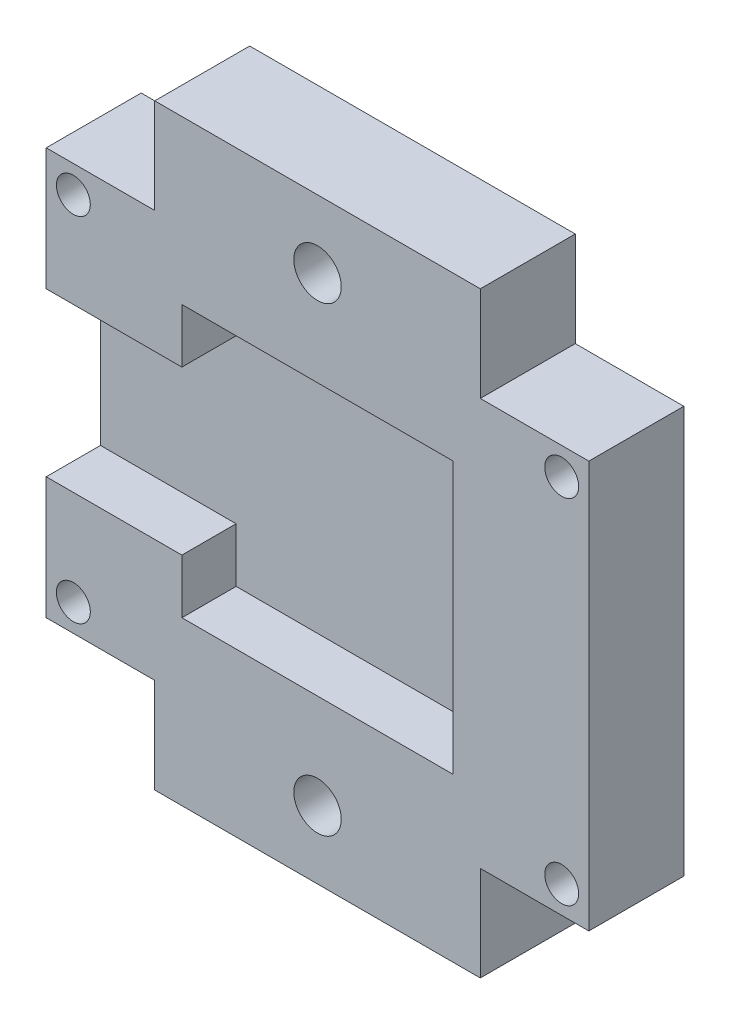
ISO-10303-21;
HEADER;
FILE_DESCRIPTION(('STEP AP214'),'2;1');
FILE_NAME('part.step','',(''),(''),'','','');
FILE_SCHEMA(('AUTOMOTIVE_DESIGN { 1 0 10303 214 1 1 1 1 }'));
ENDSEC;
DATA;
#1=APPLICATION_CONTEXT('core data for automotive mechanical design processes');
#2=APPLICATION_PROTOCOL_DEFINITION('international standard','automotive_design',2000,#1);
#3=PRODUCT_CONTEXT('',#1,'mechanical');
#4=PRODUCT('Part','Part','',(#3));
#5=PRODUCT_RELATED_PRODUCT_CATEGORY('part','',(#4));
#6=PRODUCT_DEFINITION_FORMATION('','',#4);
#7=PRODUCT_DEFINITION_CONTEXT('part definition',#1,'design');
#8=PRODUCT_DEFINITION('design','',#6,#7);
#9=PRODUCT_DEFINITION_SHAPE('','',#8);
#10=(LENGTH_UNIT() NAMED_UNIT(*) SI_UNIT(.MILLI.,.METRE.));
#11=(NAMED_UNIT(*) PLANE_ANGLE_UNIT() SI_UNIT($,.RADIAN.));
#12=(NAMED_UNIT(*) SI_UNIT($,.STERADIAN.) SOLID_ANGLE_UNIT());
#13=UNCERTAINTY_MEASURE_WITH_UNIT(LENGTH_MEASURE(1.E-05),#10,'distance_accuracy_value','');
#14=(GEOMETRIC_REPRESENTATION_CONTEXT(3) GLOBAL_UNCERTAINTY_ASSIGNED_CONTEXT((#13)) GLOBAL_UNIT_ASSIGNED_CONTEXT((#10,
#11,#12)) REPRESENTATION_CONTEXT('',''));
#15=CARTESIAN_POINT('',(0.,0.,0.));
#16=DIRECTION('',(0.,0.,1.));
#17=DIRECTION('',(1.,0.,0.));
#18=AXIS2_PLACEMENT_3D('',#15,#16,#17);
#19=CARTESIAN_POINT('',(0.,0.,7.));
#20=DIRECTION('',(0.,1.,0.));
#21=DIRECTION('',(0.,0.,1.));
#22=AXIS2_PLACEMENT_3D('',#19,#20,#21);
#23=PLANE('',#22);
#24=DIRECTION('',(0.,0.,1.));
#25=VECTOR('',#24,1.);
#26=CARTESIAN_POINT('',(32.,0.,0.));
#27=LINE('',#26,#25);
#28=CARTESIAN_POINT('',(32.,0.,0.));
#29=VERTEX_POINT('',#28);
#30=CARTESIAN_POINT('',(32.,0.,7.));
#31=VERTEX_POINT('',#30);
#32=EDGE_CURVE('E340',#29,#31,#27,.T.);
#33=ORIENTED_EDGE('',*,*,#32,.F.);
#34=DIRECTION('',(1.,0.,0.));
#35=VECTOR('',#34,1.);
#36=CARTESIAN_POINT('',(0.,0.,0.));
#37=LINE('',#36,#35);
#38=CARTESIAN_POINT('',(40.,0.,0.));
#39=VERTEX_POINT('',#38);
#40=EDGE_CURVE('E193',#29,#39,#37,.T.);
#41=ORIENTED_EDGE('',*,*,#40,.T.);
#42=DIRECTION('',(0.,0.,-1.));
#43=VECTOR('',#42,1.);
#44=CARTESIAN_POINT('',(40.,0.,7.));
#45=LINE('',#44,#43);
#46=CARTESIAN_POINT('',(40.,0.,7.));
#47=VERTEX_POINT('',#46);
#48=EDGE_CURVE('E41',#47,#39,#45,.T.);
#49=ORIENTED_EDGE('',*,*,#48,.F.);
#50=DIRECTION('',(1.,0.,0.));
#51=VECTOR('',#50,1.);
#52=CARTESIAN_POINT('',(0.,0.,7.));
#53=LINE('',#52,#51);
#54=EDGE_CURVE('E238',#31,#47,#53,.T.);
#55=ORIENTED_EDGE('',*,*,#54,.F.);
#56=EDGE_LOOP('',(#33,#41,#49,#55));
#57=FACE_BOUND('',#56,.T.);
#58=ADVANCED_FACE('F33',(#57),#23,.F.);
#59=CARTESIAN_POINT('',(0.,30.,7.));
#60=DIRECTION('',(0.,-1.,0.));
#61=DIRECTION('',(0.,0.,-1.));
#62=AXIS2_PLACEMENT_3D('',#59,#60,#61);
#63=PLANE('',#62);
#64=DIRECTION('',(0.,0.,1.));
#65=VECTOR('',#64,1.);
#66=CARTESIAN_POINT('',(8.,30.,0.));
#67=LINE('',#66,#65);
#68=CARTESIAN_POINT('',(8.,30.,0.));
#69=VERTEX_POINT('',#68);
#70=CARTESIAN_POINT('',(8.,30.,7.));
#71=VERTEX_POINT('',#70);
#72=EDGE_CURVE('E325',#69,#71,#67,.T.);
#73=ORIENTED_EDGE('',*,*,#72,.F.);
#74=DIRECTION('',(-1.,0.,0.));
#75=VECTOR('',#74,1.);
#76=CARTESIAN_POINT('',(0.,30.,0.));
#77=LINE('',#76,#75);
#78=CARTESIAN_POINT('',(0.,30.,0.));
#79=VERTEX_POINT('',#78);
#80=EDGE_CURVE('E195',#69,#79,#77,.T.);
#81=ORIENTED_EDGE('',*,*,#80,.T.);
#82=DIRECTION('',(0.,0.,-1.));
#83=VECTOR('',#82,1.);
#84=CARTESIAN_POINT('',(0.,30.,7.));
#85=LINE('',#84,#83);
#86=CARTESIAN_POINT('',(0.,30.,7.));
#87=VERTEX_POINT('',#86);
#88=EDGE_CURVE('E205',#87,#79,#85,.T.);
#89=ORIENTED_EDGE('',*,*,#88,.F.);
#90=DIRECTION('',(-1.,0.,0.));
#91=VECTOR('',#90,1.);
#92=CARTESIAN_POINT('',(0.,30.,7.));
#93=LINE('',#92,#91);
#94=EDGE_CURVE('E233',#71,#87,#93,.T.);
#95=ORIENTED_EDGE('',*,*,#94,.F.);
#96=EDGE_LOOP('',(#73,#81,#89,#95));
#97=FACE_BOUND('',#96,.T.);
#98=ADVANCED_FACE('F421',(#97),#63,.F.);
#99=CARTESIAN_POINT('',(10.,25.,3.));
#100=DIRECTION('',(-1.,0.,0.));
#101=DIRECTION('',(0.,0.,1.));
#102=AXIS2_PLACEMENT_3D('',#99,#100,#101);
#103=PLANE('',#102);
#104=DIRECTION('',(0.,-1.,0.));
#105=VECTOR('',#104,1.);
#106=CARTESIAN_POINT('',(10.,25.,3.));
#107=LINE('',#106,#105);
#108=CARTESIAN_POINT('',(10.,9.,3.));
#109=VERTEX_POINT('',#108);
#110=CARTESIAN_POINT('',(10.,5.,3.));
#111=VERTEX_POINT('',#110);
#112=EDGE_CURVE('E255',#109,#111,#107,.T.);
#113=ORIENTED_EDGE('',*,*,#112,.F.);
#114=DIRECTION('',(0.,0.,1.));
#115=VECTOR('',#114,1.);
#116=CARTESIAN_POINT('',(10.,9.,3.));
#117=LINE('',#116,#115);
#118=CARTESIAN_POINT('',(10.,9.,7.));
#119=VERTEX_POINT('',#118);
#120=EDGE_CURVE('E277',#109,#119,#117,.T.);
#121=ORIENTED_EDGE('',*,*,#120,.T.);
#122=DIRECTION('',(0.,-1.,0.));
#123=VECTOR('',#122,1.);
#124=CARTESIAN_POINT('',(10.,25.,7.));
#125=LINE('',#124,#123);
#126=CARTESIAN_POINT('',(10.,5.,7.));
#127=VERTEX_POINT('',#126);
#128=EDGE_CURVE('E265',#119,#127,#125,.T.);
#129=ORIENTED_EDGE('',*,*,#128,.T.);
#130=DIRECTION('',(0.,0.,1.));
#131=VECTOR('',#130,1.);
#132=CARTESIAN_POINT('',(10.,5.,3.));
#133=LINE('',#132,#131);
#134=EDGE_CURVE('E242',#111,#127,#133,.T.);
#135=ORIENTED_EDGE('',*,*,#134,.F.);
#136=EDGE_LOOP('',(#113,#121,#129,#135));
#137=FACE_BOUND('',#136,.T.);
#138=ADVANCED_FACE('F399',(#137),#103,.F.);
#139=CARTESIAN_POINT('',(0.,0.,7.));
#140=DIRECTION('',(1.,0.,0.));
#141=DIRECTION('',(0.,0.,-1.));
#142=AXIS2_PLACEMENT_3D('',#139,#140,#141);
#143=PLANE('',#142);
#144=DIRECTION('',(0.,-1.,0.));
#145=VECTOR('',#144,1.);
#146=CARTESIAN_POINT('',(0.,0.,7.));
#147=LINE('',#146,#145);
#148=CARTESIAN_POINT('',(0.,9.,7.));
#149=VERTEX_POINT('',#148);
#150=CARTESIAN_POINT('',(0.,0.,7.));
#151=VERTEX_POINT('',#150);
#152=EDGE_CURVE('E204',#149,#151,#147,.T.);
#153=ORIENTED_EDGE('',*,*,#152,.F.);
#154=DIRECTION('',(0.,0.,1.));
#155=VECTOR('',#154,1.);
#156=CARTESIAN_POINT('',(0.,9.,7.));
#157=LINE('',#156,#155);
#158=CARTESIAN_POINT('',(0.,9.,3.));
#159=VERTEX_POINT('',#158);
#160=EDGE_CURVE('E287',#159,#149,#157,.T.);
#161=ORIENTED_EDGE('',*,*,#160,.F.);
#162=DIRECTION('',(0.,-1.,0.));
#163=VECTOR('',#162,1.);
#164=CARTESIAN_POINT('',(0.,21.,3.));
#165=LINE('',#164,#163);
#166=CARTESIAN_POINT('',(0.,21.,3.));
#167=VERTEX_POINT('',#166);
#168=EDGE_CURVE('E294',#167,#159,#165,.T.);
#169=ORIENTED_EDGE('',*,*,#168,.F.);
#170=DIRECTION('',(0.,0.,-1.));
#171=VECTOR('',#170,1.);
#172=CARTESIAN_POINT('',(0.,21.,7.));
#173=LINE('',#172,#171);
#174=CARTESIAN_POINT('',(0.,21.,7.));
#175=VERTEX_POINT('',#174);
#176=EDGE_CURVE('E297',#175,#167,#173,.T.);
#177=ORIENTED_EDGE('',*,*,#176,.F.);
#178=EDGE_CURVE('E239',#87,#175,#147,.T.);
#179=ORIENTED_EDGE('',*,*,#178,.F.);
#180=ORIENTED_EDGE('',*,*,#88,.T.);
#181=DIRECTION('',(0.,-1.,0.));
#182=VECTOR('',#181,1.);
#183=CARTESIAN_POINT('',(0.,0.,0.));
#184=LINE('',#183,#182);
#185=CARTESIAN_POINT('',(0.,0.,0.));
#186=VERTEX_POINT('',#185);
#187=EDGE_CURVE('E197',#79,#186,#184,.T.);
#188=ORIENTED_EDGE('',*,*,#187,.T.);
#189=DIRECTION('',(0.,0.,-1.));
#190=VECTOR('',#189,1.);
#191=CARTESIAN_POINT('',(0.,0.,7.));
#192=LINE('',#191,#190);
#193=EDGE_CURVE('E11',#151,#186,#192,.T.);
#194=ORIENTED_EDGE('',*,*,#193,.F.);
#195=EDGE_LOOP('',(#153,#161,#169,#177,#179,#180,#188,#194));
#196=FACE_BOUND('',#195,.T.);
#197=ADVANCED_FACE('F35',(#196),#143,.F.);
#198=CARTESIAN_POINT('',(8.,0.,0.));
#199=VERTEX_POINT('',#198);
#200=EDGE_CURVE('E183',#186,#199,#37,.T.);
#201=ORIENTED_EDGE('',*,*,#200,.T.);
#202=DIRECTION('',(0.,0.,1.));
#203=VECTOR('',#202,1.);
#204=CARTESIAN_POINT('',(8.,0.,0.));
#205=LINE('',#204,#203);
#206=CARTESIAN_POINT('',(8.,0.,7.));
#207=VERTEX_POINT('',#206);
#208=EDGE_CURVE('E168',#199,#207,#205,.T.);
#209=ORIENTED_EDGE('',*,*,#208,.T.);
#210=EDGE_CURVE('E236',#151,#207,#53,.T.);
#211=ORIENTED_EDGE('',*,*,#210,.F.);
#212=ORIENTED_EDGE('',*,*,#193,.T.);
#213=EDGE_LOOP('',(#201,#209,#211,#212));
#214=FACE_BOUND('',#213,.T.);
#215=ADVANCED_FACE('F189',(#214),#23,.F.);
#216=CARTESIAN_POINT('',(40.,0.,7.));
#217=DIRECTION('',(-1.,0.,0.));
#218=DIRECTION('',(0.,0.,1.));
#219=AXIS2_PLACEMENT_3D('',#216,#217,#218);
#220=PLANE('',#219);
#221=DIRECTION('',(0.,1.,0.));
#222=VECTOR('',#221,1.);
#223=CARTESIAN_POINT('',(40.,0.,0.));
#224=LINE('',#223,#222);
#225=CARTESIAN_POINT('',(40.,30.,0.));
#226=VERTEX_POINT('',#225);
#227=EDGE_CURVE('E192',#39,#226,#224,.T.);
#228=ORIENTED_EDGE('',*,*,#227,.T.);
#229=DIRECTION('',(0.,0.,-1.));
#230=VECTOR('',#229,1.);
#231=CARTESIAN_POINT('',(40.,30.,7.));
#232=LINE('',#231,#230);
#233=CARTESIAN_POINT('',(40.,30.,7.));
#234=VERTEX_POINT('',#233);
#235=EDGE_CURVE('E208',#234,#226,#232,.T.);
#236=ORIENTED_EDGE('',*,*,#235,.F.);
#237=DIRECTION('',(0.,1.,0.));
#238=VECTOR('',#237,1.);
#239=CARTESIAN_POINT('',(40.,0.,7.));
#240=LINE('',#239,#238);
#241=EDGE_CURVE('E218',#47,#234,#240,.T.);
#242=ORIENTED_EDGE('',*,*,#241,.F.);
#243=ORIENTED_EDGE('',*,*,#48,.T.);
#244=EDGE_LOOP('',(#228,#236,#242,#243));
#245=FACE_BOUND('',#244,.T.);
#246=ADVANCED_FACE('F216',(#245),#220,.F.);
#247=CARTESIAN_POINT('',(32.,30.,0.));
#248=VERTEX_POINT('',#247);
#249=EDGE_CURVE('E201',#226,#248,#77,.T.);
#250=ORIENTED_EDGE('',*,*,#249,.T.);
#251=DIRECTION('',(0.,0.,1.));
#252=VECTOR('',#251,1.);
#253=CARTESIAN_POINT('',(32.,30.,0.));
#254=LINE('',#253,#252);
#255=CARTESIAN_POINT('',(32.,30.,7.));
#256=VERTEX_POINT('',#255);
#257=EDGE_CURVE('E230',#248,#256,#254,.T.);
#258=ORIENTED_EDGE('',*,*,#257,.T.);
#259=EDGE_CURVE('E209',#234,#256,#93,.T.);
#260=ORIENTED_EDGE('',*,*,#259,.F.);
#261=ORIENTED_EDGE('',*,*,#235,.T.);
#262=EDGE_LOOP('',(#250,#258,#260,#261));
#263=FACE_BOUND('',#262,.T.);
#264=ADVANCED_FACE('F228',(#263),#63,.F.);
#265=CARTESIAN_POINT('',(0.,0.,7.));
#266=DIRECTION('',(0.,0.,-1.));
#267=DIRECTION('',(-1.,0.,0.));
#268=AXIS2_PLACEMENT_3D('',#265,#266,#267);
#269=PLANE('',#268);
#270=CARTESIAN_POINT('',(20.,32.,7.));
#271=DIRECTION('',(0.,0.,1.));
#272=DIRECTION('',(-1.,0.,0.));
#273=AXIS2_PLACEMENT_3D('',#270,#271,#272);
#274=CIRCLE('',#273,1.75);
#275=CARTESIAN_POINT('',(18.25,32.,7.));
#276=VERTEX_POINT('',#275);
#277=EDGE_CURVE('E364',#276,#276,#274,.T.);
#278=ORIENTED_EDGE('',*,*,#277,.F.);
#279=EDGE_LOOP('',(#278));
#280=FACE_BOUND('',#279,.T.);
#281=CARTESIAN_POINT('',(20.,-2.,7.));
#282=DIRECTION('',(0.,0.,1.));
#283=DIRECTION('',(1.,0.,0.));
#284=AXIS2_PLACEMENT_3D('',#281,#282,#283);
#285=CIRCLE('',#284,1.75);
#286=CARTESIAN_POINT('',(21.75,-2.,7.));
#287=VERTEX_POINT('',#286);
#288=EDGE_CURVE('E358',#287,#287,#285,.T.);
#289=ORIENTED_EDGE('',*,*,#288,.F.);
#290=EDGE_LOOP('',(#289));
#291=FACE_BOUND('',#290,.T.);
#292=CARTESIAN_POINT('',(38.,28.,7.));
#293=DIRECTION('',(0.,0.,1.));
#294=DIRECTION('',(-1.,0.,0.));
#295=AXIS2_PLACEMENT_3D('',#292,#293,#294);
#296=CIRCLE('',#295,1.25);
#297=CARTESIAN_POINT('',(36.75,28.,7.));
#298=VERTEX_POINT('',#297);
#299=EDGE_CURVE('E320',#298,#298,#296,.T.);
#300=ORIENTED_EDGE('',*,*,#299,.F.);
#301=EDGE_LOOP('',(#300));
#302=FACE_BOUND('',#301,.T.);
#303=CARTESIAN_POINT('',(38.,2.,7.));
#304=DIRECTION('',(0.,0.,1.));
#305=DIRECTION('',(1.,0.,0.));
#306=AXIS2_PLACEMENT_3D('',#303,#304,#305);
#307=CIRCLE('',#306,1.25);
#308=CARTESIAN_POINT('',(39.25,2.,7.));
#309=VERTEX_POINT('',#308);
#310=EDGE_CURVE('E314',#309,#309,#307,.T.);
#311=ORIENTED_EDGE('',*,*,#310,.F.);
#312=EDGE_LOOP('',(#311));
#313=FACE_BOUND('',#312,.T.);
#314=CARTESIAN_POINT('',(2.,2.,7.));
#315=DIRECTION('',(0.,0.,1.));
#316=DIRECTION('',(-1.,0.,0.));
#317=AXIS2_PLACEMENT_3D('',#314,#315,#316);
#318=CIRCLE('',#317,1.25);
#319=CARTESIAN_POINT('',(0.750000000000001,2.,7.));
#320=VERTEX_POINT('',#319);
#321=EDGE_CURVE('E307',#320,#320,#318,.T.);
#322=ORIENTED_EDGE('',*,*,#321,.F.);
#323=EDGE_LOOP('',(#322));
#324=FACE_BOUND('',#323,.T.);
#325=CARTESIAN_POINT('',(2.,28.,7.));
#326=DIRECTION('',(0.,0.,1.));
#327=DIRECTION('',(1.,0.,0.));
#328=AXIS2_PLACEMENT_3D('',#325,#326,#327);
#329=CIRCLE('',#328,1.25);
#330=CARTESIAN_POINT('',(3.25,28.,7.));
#331=VERTEX_POINT('',#330);
#332=EDGE_CURVE('E301',#331,#331,#329,.T.);
#333=ORIENTED_EDGE('',*,*,#332,.F.);
#334=EDGE_LOOP('',(#333));
#335=FACE_BOUND('',#334,.T.);
#336=ORIENTED_EDGE('',*,*,#128,.F.);
#337=DIRECTION('',(-1.,0.,0.));
#338=VECTOR('',#337,1.);
#339=CARTESIAN_POINT('',(26.,9.,7.));
#340=LINE('',#339,#338);
#341=EDGE_CURVE('E283',#119,#149,#340,.T.);
#342=ORIENTED_EDGE('',*,*,#341,.T.);
#343=ORIENTED_EDGE('',*,*,#152,.T.);
#344=ORIENTED_EDGE('',*,*,#210,.T.);
#345=DIRECTION('',(0.,-1.,0.));
#346=VECTOR('',#345,1.);
#347=CARTESIAN_POINT('',(8.,0.,7.));
#348=LINE('',#347,#346);
#349=CARTESIAN_POINT('',(8.,-7.,7.));
#350=VERTEX_POINT('',#349);
#351=EDGE_CURVE('E48',#207,#350,#348,.T.);
#352=ORIENTED_EDGE('',*,*,#351,.T.);
#353=DIRECTION('',(1.,0.,0.));
#354=VECTOR('',#353,1.);
#355=CARTESIAN_POINT('',(8.,-7.,7.));
#356=LINE('',#355,#354);
#357=CARTESIAN_POINT('',(32.,-7.00000000000001,7.));
#358=VERTEX_POINT('',#357);
#359=EDGE_CURVE('E351',#350,#358,#356,.T.);
#360=ORIENTED_EDGE('',*,*,#359,.T.);
#361=DIRECTION('',(0.,1.,0.));
#362=VECTOR('',#361,1.);
#363=CARTESIAN_POINT('',(32.,0.,7.));
#364=LINE('',#363,#362);
#365=EDGE_CURVE('E187',#358,#31,#364,.T.);
#366=ORIENTED_EDGE('',*,*,#365,.T.);
#367=ORIENTED_EDGE('',*,*,#54,.T.);
#368=ORIENTED_EDGE('',*,*,#241,.T.);
#369=ORIENTED_EDGE('',*,*,#259,.T.);
#370=DIRECTION('',(0.,1.,0.));
#371=VECTOR('',#370,1.);
#372=CARTESIAN_POINT('',(32.,30.,7.));
#373=LINE('',#372,#371);
#374=CARTESIAN_POINT('',(32.,37.,7.));
#375=VERTEX_POINT('',#374);
#376=EDGE_CURVE('E56',#256,#375,#373,.T.);
#377=ORIENTED_EDGE('',*,*,#376,.T.);
#378=DIRECTION('',(-1.,0.,0.));
#379=VECTOR('',#378,1.);
#380=CARTESIAN_POINT('',(8.,37.,7.));
#381=LINE('',#380,#379);
#382=CARTESIAN_POINT('',(8.,37.,7.));
#383=VERTEX_POINT('',#382);
#384=EDGE_CURVE('E332',#375,#383,#381,.T.);
#385=ORIENTED_EDGE('',*,*,#384,.T.);
#386=DIRECTION('',(0.,-1.,0.));
#387=VECTOR('',#386,1.);
#388=CARTESIAN_POINT('',(8.,30.,7.));
#389=LINE('',#388,#387);
#390=EDGE_CURVE('E337',#383,#71,#389,.T.);
#391=ORIENTED_EDGE('',*,*,#390,.T.);
#392=ORIENTED_EDGE('',*,*,#94,.T.);
#393=ORIENTED_EDGE('',*,*,#178,.T.);
#394=DIRECTION('',(-1.,0.,0.));
#395=VECTOR('',#394,1.);
#396=CARTESIAN_POINT('',(26.,21.,7.));
#397=LINE('',#396,#395);
#398=CARTESIAN_POINT('',(10.,21.,7.));
#399=VERTEX_POINT('',#398);
#400=EDGE_CURVE('E284',#399,#175,#397,.T.);
#401=ORIENTED_EDGE('',*,*,#400,.F.);
#402=CARTESIAN_POINT('',(10.,25.,7.));
#403=VERTEX_POINT('',#402);
#404=EDGE_CURVE('E262',#403,#399,#125,.T.);
#405=ORIENTED_EDGE('',*,*,#404,.F.);
#406=DIRECTION('',(-1.,0.,0.));
#407=VECTOR('',#406,1.);
#408=CARTESIAN_POINT('',(10.,25.,7.));
#409=LINE('',#408,#407);
#410=CARTESIAN_POINT('',(30.,25.,7.));
#411=VERTEX_POINT('',#410);
#412=EDGE_CURVE('E252',#411,#403,#409,.T.);
#413=ORIENTED_EDGE('',*,*,#412,.F.);
#414=DIRECTION('',(0.,1.,0.));
#415=VECTOR('',#414,1.);
#416=CARTESIAN_POINT('',(30.,25.,7.));
#417=LINE('',#416,#415);
#418=CARTESIAN_POINT('',(30.,5.,7.));
#419=VERTEX_POINT('',#418);
#420=EDGE_CURVE('E256',#419,#411,#417,.T.);
#421=ORIENTED_EDGE('',*,*,#420,.F.);
#422=DIRECTION('',(1.,0.,0.));
#423=VECTOR('',#422,1.);
#424=CARTESIAN_POINT('',(10.,5.,7.));
#425=LINE('',#424,#423);
#426=EDGE_CURVE('E259',#127,#419,#425,.T.);
#427=ORIENTED_EDGE('',*,*,#426,.F.);
#428=EDGE_LOOP('',(#336,#342,#343,#344,#352,#360,#366,#367,#368,#369,#377,#385,#391,#392,#393,
#401,#405,#413,#421,#427));
#429=FACE_BOUND('',#428,.T.);
#430=ADVANCED_FACE('F379',(#280,#291,#302,#313,#324,#335,#429),#269,.F.);
#431=CARTESIAN_POINT('',(0.,0.,0.));
#432=DIRECTION('',(0.,0.,-1.));
#433=DIRECTION('',(-1.,0.,0.));
#434=AXIS2_PLACEMENT_3D('',#431,#432,#433);
#435=PLANE('',#434);
#436=CARTESIAN_POINT('',(20.,32.,0.));
#437=DIRECTION('',(0.,0.,1.));
#438=DIRECTION('',(-1.,0.,0.));
#439=AXIS2_PLACEMENT_3D('',#436,#437,#438);
#440=CIRCLE('',#439,1.75);
#441=CARTESIAN_POINT('',(18.25,32.,0.));
#442=VERTEX_POINT('',#441);
#443=EDGE_CURVE('E361',#442,#442,#440,.T.);
#444=ORIENTED_EDGE('',*,*,#443,.T.);
#445=EDGE_LOOP('',(#444));
#446=FACE_BOUND('',#445,.T.);
#447=CARTESIAN_POINT('',(20.,-2.,0.));
#448=DIRECTION('',(0.,0.,1.));
#449=DIRECTION('',(1.,0.,0.));
#450=AXIS2_PLACEMENT_3D('',#447,#448,#449);
#451=CIRCLE('',#450,1.75);
#452=CARTESIAN_POINT('',(21.75,-2.,0.));
#453=VERTEX_POINT('',#452);
#454=EDGE_CURVE('E355',#453,#453,#451,.T.);
#455=ORIENTED_EDGE('',*,*,#454,.T.);
#456=EDGE_LOOP('',(#455));
#457=FACE_BOUND('',#456,.T.);
#458=CARTESIAN_POINT('',(38.,28.,0.));
#459=DIRECTION('',(0.,0.,1.));
#460=DIRECTION('',(-1.,0.,0.));
#461=AXIS2_PLACEMENT_3D('',#458,#459,#460);
#462=CIRCLE('',#461,1.25);
#463=CARTESIAN_POINT('',(36.75,28.,0.));
#464=VERTEX_POINT('',#463);
#465=EDGE_CURVE('E304',#464,#464,#462,.T.);
#466=ORIENTED_EDGE('',*,*,#465,.T.);
#467=EDGE_LOOP('',(#466));
#468=FACE_BOUND('',#467,.T.);
#469=CARTESIAN_POINT('',(38.,2.,0.));
#470=DIRECTION('',(0.,0.,1.));
#471=DIRECTION('',(1.,0.,0.));
#472=AXIS2_PLACEMENT_3D('',#469,#470,#471);
#473=CIRCLE('',#472,1.25);
#474=CARTESIAN_POINT('',(39.25,2.,0.));
#475=VERTEX_POINT('',#474);
#476=EDGE_CURVE('E317',#475,#475,#473,.T.);
#477=ORIENTED_EDGE('',*,*,#476,.T.);
#478=EDGE_LOOP('',(#477));
#479=FACE_BOUND('',#478,.T.);
#480=CARTESIAN_POINT('',(2.,2.,0.));
#481=DIRECTION('',(0.,0.,1.));
#482=DIRECTION('',(-1.,0.,0.));
#483=AXIS2_PLACEMENT_3D('',#480,#481,#482);
#484=CIRCLE('',#483,1.25);
#485=CARTESIAN_POINT('',(0.750000000000001,2.,0.));
#486=VERTEX_POINT('',#485);
#487=EDGE_CURVE('E310',#486,#486,#484,.T.);
#488=ORIENTED_EDGE('',*,*,#487,.T.);
#489=EDGE_LOOP('',(#488));
#490=FACE_BOUND('',#489,.T.);
#491=CARTESIAN_POINT('',(2.,28.,0.));
#492=DIRECTION('',(0.,0.,1.));
#493=DIRECTION('',(1.,0.,0.));
#494=AXIS2_PLACEMENT_3D('',#491,#492,#493);
#495=CIRCLE('',#494,1.25);
#496=CARTESIAN_POINT('',(3.25,28.,0.));
#497=VERTEX_POINT('',#496);
#498=EDGE_CURVE('E300',#497,#497,#495,.T.);
#499=ORIENTED_EDGE('',*,*,#498,.T.);
#500=EDGE_LOOP('',(#499));
#501=FACE_BOUND('',#500,.T.);
#502=ORIENTED_EDGE('',*,*,#187,.F.);
#503=ORIENTED_EDGE('',*,*,#80,.F.);
#504=DIRECTION('',(0.,-1.,0.));
#505=VECTOR('',#504,1.);
#506=CARTESIAN_POINT('',(8.,30.,0.));
#507=LINE('',#506,#505);
#508=CARTESIAN_POINT('',(8.,37.,0.));
#509=VERTEX_POINT('',#508);
#510=EDGE_CURVE('E335',#509,#69,#507,.T.);
#511=ORIENTED_EDGE('',*,*,#510,.F.);
#512=DIRECTION('',(-1.,0.,0.));
#513=VECTOR('',#512,1.);
#514=CARTESIAN_POINT('',(8.,37.,0.));
#515=LINE('',#514,#513);
#516=CARTESIAN_POINT('',(32.,37.,0.));
#517=VERTEX_POINT('',#516);
#518=EDGE_CURVE('E327',#517,#509,#515,.T.);
#519=ORIENTED_EDGE('',*,*,#518,.F.);
#520=DIRECTION('',(0.,1.,0.));
#521=VECTOR('',#520,1.);
#522=CARTESIAN_POINT('',(32.,30.,0.));
#523=LINE('',#522,#521);
#524=EDGE_CURVE('E226',#248,#517,#523,.T.);
#525=ORIENTED_EDGE('',*,*,#524,.F.);
#526=ORIENTED_EDGE('',*,*,#249,.F.);
#527=ORIENTED_EDGE('',*,*,#227,.F.);
#528=ORIENTED_EDGE('',*,*,#40,.F.);
#529=DIRECTION('',(0.,1.,0.));
#530=VECTOR('',#529,1.);
#531=CARTESIAN_POINT('',(32.,0.,0.));
#532=LINE('',#531,#530);
#533=CARTESIAN_POINT('',(32.,-7.00000000000001,0.));
#534=VERTEX_POINT('',#533);
#535=EDGE_CURVE('E177',#534,#29,#532,.T.);
#536=ORIENTED_EDGE('',*,*,#535,.F.);
#537=DIRECTION('',(1.,0.,0.));
#538=VECTOR('',#537,1.);
#539=CARTESIAN_POINT('',(8.,-7.,0.));
#540=LINE('',#539,#538);
#541=CARTESIAN_POINT('',(8.,-7.,0.));
#542=VERTEX_POINT('',#541);
#543=EDGE_CURVE('E186',#542,#534,#540,.T.);
#544=ORIENTED_EDGE('',*,*,#543,.F.);
#545=DIRECTION('',(0.,-1.,0.));
#546=VECTOR('',#545,1.);
#547=CARTESIAN_POINT('',(8.,0.,0.));
#548=LINE('',#547,#546);
#549=EDGE_CURVE('E171',#199,#542,#548,.T.);
#550=ORIENTED_EDGE('',*,*,#549,.F.);
#551=ORIENTED_EDGE('',*,*,#200,.F.);
#552=EDGE_LOOP('',(#502,#503,#511,#519,#525,#526,#527,#528,#536,#544,#550,#551));
#553=FACE_BOUND('',#552,.T.);
#554=ADVANCED_FACE('F182',(#446,#457,#468,#479,#490,#501,#553),#435,.T.);
#555=ORIENTED_EDGE('',*,*,#404,.T.);
#556=DIRECTION('',(0.,0.,-1.));
#557=VECTOR('',#556,1.);
#558=CARTESIAN_POINT('',(10.,21.,3.));
#559=LINE('',#558,#557);
#560=CARTESIAN_POINT('',(10.,21.,3.));
#561=VERTEX_POINT('',#560);
#562=EDGE_CURVE('E280',#399,#561,#559,.T.);
#563=ORIENTED_EDGE('',*,*,#562,.T.);
#564=CARTESIAN_POINT('',(10.,25.,3.));
#565=VERTEX_POINT('',#564);
#566=EDGE_CURVE('E274',#565,#561,#107,.T.);
#567=ORIENTED_EDGE('',*,*,#566,.F.);
#568=DIRECTION('',(0.,0.,1.));
#569=VECTOR('',#568,1.);
#570=CARTESIAN_POINT('',(10.,25.,3.));
#571=LINE('',#570,#569);
#572=EDGE_CURVE('E250',#565,#403,#571,.T.);
#573=ORIENTED_EDGE('',*,*,#572,.T.);
#574=EDGE_LOOP('',(#555,#563,#567,#573));
#575=FACE_BOUND('',#574,.T.);
#576=ADVANCED_FACE('F437',(#575),#103,.F.);
#577=CARTESIAN_POINT('',(10.,25.,3.));
#578=DIRECTION('',(0.,1.,0.));
#579=DIRECTION('',(0.,0.,1.));
#580=AXIS2_PLACEMENT_3D('',#577,#578,#579);
#581=PLANE('',#580);
#582=ORIENTED_EDGE('',*,*,#412,.T.);
#583=ORIENTED_EDGE('',*,*,#572,.F.);
#584=DIRECTION('',(-1.,0.,0.));
#585=VECTOR('',#584,1.);
#586=CARTESIAN_POINT('',(10.,25.,3.));
#587=LINE('',#586,#585);
#588=CARTESIAN_POINT('',(30.,25.,3.));
#589=VERTEX_POINT('',#588);
#590=EDGE_CURVE('E246',#589,#565,#587,.T.);
#591=ORIENTED_EDGE('',*,*,#590,.F.);
#592=DIRECTION('',(0.,0.,1.));
#593=VECTOR('',#592,1.);
#594=CARTESIAN_POINT('',(30.,25.,3.));
#595=LINE('',#594,#593);
#596=EDGE_CURVE('E248',#589,#411,#595,.T.);
#597=ORIENTED_EDGE('',*,*,#596,.T.);
#598=EDGE_LOOP('',(#582,#583,#591,#597));
#599=FACE_BOUND('',#598,.T.);
#600=ADVANCED_FACE('F442',(#599),#581,.F.);
#601=CARTESIAN_POINT('',(30.,25.,3.));
#602=DIRECTION('',(1.,0.,0.));
#603=DIRECTION('',(0.,0.,-1.));
#604=AXIS2_PLACEMENT_3D('',#601,#602,#603);
#605=PLANE('',#604);
#606=ORIENTED_EDGE('',*,*,#420,.T.);
#607=ORIENTED_EDGE('',*,*,#596,.F.);
#608=DIRECTION('',(0.,1.,0.));
#609=VECTOR('',#608,1.);
#610=CARTESIAN_POINT('',(30.,25.,3.));
#611=LINE('',#610,#609);
#612=CARTESIAN_POINT('',(30.,5.,3.));
#613=VERTEX_POINT('',#612);
#614=EDGE_CURVE('E268',#613,#589,#611,.T.);
#615=ORIENTED_EDGE('',*,*,#614,.F.);
#616=DIRECTION('',(0.,0.,1.));
#617=VECTOR('',#616,1.);
#618=CARTESIAN_POINT('',(30.,5.,3.));
#619=LINE('',#618,#617);
#620=EDGE_CURVE('E245',#613,#419,#619,.T.);
#621=ORIENTED_EDGE('',*,*,#620,.T.);
#622=EDGE_LOOP('',(#606,#607,#615,#621));
#623=FACE_BOUND('',#622,.T.);
#624=ADVANCED_FACE('F448',(#623),#605,.F.);
#625=CARTESIAN_POINT('',(10.,5.,3.));
#626=DIRECTION('',(0.,-1.,0.));
#627=DIRECTION('',(0.,0.,-1.));
#628=AXIS2_PLACEMENT_3D('',#625,#626,#627);
#629=PLANE('',#628);
#630=ORIENTED_EDGE('',*,*,#426,.T.);
#631=ORIENTED_EDGE('',*,*,#620,.F.);
#632=DIRECTION('',(1.,0.,0.));
#633=VECTOR('',#632,1.);
#634=CARTESIAN_POINT('',(10.,5.,3.));
#635=LINE('',#634,#633);
#636=EDGE_CURVE('E271',#111,#613,#635,.T.);
#637=ORIENTED_EDGE('',*,*,#636,.F.);
#638=ORIENTED_EDGE('',*,*,#134,.T.);
#639=EDGE_LOOP('',(#630,#631,#637,#638));
#640=FACE_BOUND('',#639,.T.);
#641=ADVANCED_FACE('F402',(#640),#629,.F.);
#642=CARTESIAN_POINT('',(0.,0.,3.));
#643=DIRECTION('',(0.,0.,1.));
#644=DIRECTION('',(1.,0.,0.));
#645=AXIS2_PLACEMENT_3D('',#642,#643,#644);
#646=PLANE('',#645);
#647=ORIENTED_EDGE('',*,*,#566,.T.);
#648=DIRECTION('',(-1.,0.,0.));
#649=VECTOR('',#648,1.);
#650=CARTESIAN_POINT('',(26.,21.,3.));
#651=LINE('',#650,#649);
#652=EDGE_CURVE('E286',#561,#167,#651,.T.);
#653=ORIENTED_EDGE('',*,*,#652,.T.);
#654=ORIENTED_EDGE('',*,*,#168,.T.);
#655=DIRECTION('',(-1.,0.,0.));
#656=VECTOR('',#655,1.);
#657=CARTESIAN_POINT('',(26.,9.,3.));
#658=LINE('',#657,#656);
#659=EDGE_CURVE('E289',#109,#159,#658,.T.);
#660=ORIENTED_EDGE('',*,*,#659,.F.);
#661=ORIENTED_EDGE('',*,*,#112,.T.);
#662=ORIENTED_EDGE('',*,*,#636,.T.);
#663=ORIENTED_EDGE('',*,*,#614,.T.);
#664=ORIENTED_EDGE('',*,*,#590,.T.);
#665=EDGE_LOOP('',(#647,#653,#654,#660,#661,#662,#663,#664));
#666=FACE_BOUND('',#665,.T.);
#667=ADVANCED_FACE('F405',(#666),#646,.T.);
#668=CARTESIAN_POINT('',(26.,9.,7.));
#669=DIRECTION('',(0.,-1.,0.));
#670=DIRECTION('',(0.,0.,-1.));
#671=AXIS2_PLACEMENT_3D('',#668,#669,#670);
#672=PLANE('',#671);
#673=ORIENTED_EDGE('',*,*,#659,.T.);
#674=ORIENTED_EDGE('',*,*,#160,.T.);
#675=ORIENTED_EDGE('',*,*,#341,.F.);
#676=ORIENTED_EDGE('',*,*,#120,.F.);
#677=EDGE_LOOP('',(#673,#674,#675,#676));
#678=FACE_BOUND('',#677,.T.);
#679=ADVANCED_FACE('F411',(#678),#672,.F.);
#680=CARTESIAN_POINT('',(26.,21.,7.));
#681=DIRECTION('',(0.,1.,0.));
#682=DIRECTION('',(0.,0.,1.));
#683=AXIS2_PLACEMENT_3D('',#680,#681,#682);
#684=PLANE('',#683);
#685=ORIENTED_EDGE('',*,*,#400,.T.);
#686=ORIENTED_EDGE('',*,*,#176,.T.);
#687=ORIENTED_EDGE('',*,*,#652,.F.);
#688=ORIENTED_EDGE('',*,*,#562,.F.);
#689=EDGE_LOOP('',(#685,#686,#687,#688));
#690=FACE_BOUND('',#689,.T.);
#691=ADVANCED_FACE('F458',(#690),#684,.F.);
#692=CARTESIAN_POINT('',(2.,28.,0.));
#693=DIRECTION('',(0.,0.,1.));
#694=DIRECTION('',(1.,0.,0.));
#695=AXIS2_PLACEMENT_3D('',#692,#693,#694);
#696=CYLINDRICAL_SURFACE('',#695,1.25);
#697=ORIENTED_EDGE('',*,*,#498,.F.);
#698=EDGE_LOOP('',(#697));
#699=FACE_BOUND('',#698,.T.);
#700=ORIENTED_EDGE('',*,*,#332,.T.);
#701=EDGE_LOOP('',(#700));
#702=FACE_BOUND('',#701,.T.);
#703=ADVANCED_FACE('F495',(#699,#702),#696,.F.);
#704=CARTESIAN_POINT('',(2.,2.,0.));
#705=DIRECTION('',(0.,0.,1.));
#706=DIRECTION('',(1.,0.,0.));
#707=AXIS2_PLACEMENT_3D('',#704,#705,#706);
#708=CYLINDRICAL_SURFACE('',#707,1.25);
#709=ORIENTED_EDGE('',*,*,#487,.F.);
#710=EDGE_LOOP('',(#709));
#711=FACE_BOUND('',#710,.T.);
#712=ORIENTED_EDGE('',*,*,#321,.T.);
#713=EDGE_LOOP('',(#712));
#714=FACE_BOUND('',#713,.T.);
#715=ADVANCED_FACE('F491',(#711,#714),#708,.F.);
#716=CARTESIAN_POINT('',(38.,2.,0.));
#717=DIRECTION('',(0.,0.,1.));
#718=DIRECTION('',(1.,0.,0.));
#719=AXIS2_PLACEMENT_3D('',#716,#717,#718);
#720=CYLINDRICAL_SURFACE('',#719,1.25);
#721=ORIENTED_EDGE('',*,*,#476,.F.);
#722=EDGE_LOOP('',(#721));
#723=FACE_BOUND('',#722,.T.);
#724=ORIENTED_EDGE('',*,*,#310,.T.);
#725=EDGE_LOOP('',(#724));
#726=FACE_BOUND('',#725,.T.);
#727=ADVANCED_FACE('F487',(#723,#726),#720,.F.);
#728=CARTESIAN_POINT('',(38.,28.,0.));
#729=DIRECTION('',(0.,0.,1.));
#730=DIRECTION('',(1.,0.,0.));
#731=AXIS2_PLACEMENT_3D('',#728,#729,#730);
#732=CYLINDRICAL_SURFACE('',#731,1.25);
#733=ORIENTED_EDGE('',*,*,#465,.F.);
#734=EDGE_LOOP('',(#733));
#735=FACE_BOUND('',#734,.T.);
#736=ORIENTED_EDGE('',*,*,#299,.T.);
#737=EDGE_LOOP('',(#736));
#738=FACE_BOUND('',#737,.T.);
#739=ADVANCED_FACE('F484',(#735,#738),#732,.F.);
#740=CARTESIAN_POINT('',(8.,30.,0.));
#741=DIRECTION('',(-1.,0.,0.));
#742=DIRECTION('',(0.,0.,1.));
#743=AXIS2_PLACEMENT_3D('',#740,#741,#742);
#744=PLANE('',#743);
#745=ORIENTED_EDGE('',*,*,#390,.F.);
#746=DIRECTION('',(0.,0.,1.));
#747=VECTOR('',#746,1.);
#748=CARTESIAN_POINT('',(8.,37.,0.));
#749=LINE('',#748,#747);
#750=EDGE_CURVE('E311',#509,#383,#749,.T.);
#751=ORIENTED_EDGE('',*,*,#750,.F.);
#752=ORIENTED_EDGE('',*,*,#510,.T.);
#753=ORIENTED_EDGE('',*,*,#72,.T.);
#754=EDGE_LOOP('',(#745,#751,#752,#753));
#755=FACE_BOUND('',#754,.T.);
#756=ADVANCED_FACE('F466',(#755),#744,.T.);
#757=CARTESIAN_POINT('',(8.,37.,0.));
#758=DIRECTION('',(0.,1.,0.));
#759=DIRECTION('',(-1.,0.,0.));
#760=AXIS2_PLACEMENT_3D('',#757,#758,#759);
#761=PLANE('',#760);
#762=ORIENTED_EDGE('',*,*,#384,.F.);
#763=DIRECTION('',(0.,0.,1.));
#764=VECTOR('',#763,1.);
#765=CARTESIAN_POINT('',(32.,37.,0.));
#766=LINE('',#765,#764);
#767=EDGE_CURVE('E329',#517,#375,#766,.T.);
#768=ORIENTED_EDGE('',*,*,#767,.F.);
#769=ORIENTED_EDGE('',*,*,#518,.T.);
#770=ORIENTED_EDGE('',*,*,#750,.T.);
#771=EDGE_LOOP('',(#762,#768,#769,#770));
#772=FACE_BOUND('',#771,.T.);
#773=ADVANCED_FACE('F469',(#772),#761,.T.);
#774=CARTESIAN_POINT('',(32.,30.,0.));
#775=DIRECTION('',(1.,0.,0.));
#776=DIRECTION('',(0.,0.,-1.));
#777=AXIS2_PLACEMENT_3D('',#774,#775,#776);
#778=PLANE('',#777);
#779=ORIENTED_EDGE('',*,*,#376,.F.);
#780=ORIENTED_EDGE('',*,*,#257,.F.);
#781=ORIENTED_EDGE('',*,*,#524,.T.);
#782=ORIENTED_EDGE('',*,*,#767,.T.);
#783=EDGE_LOOP('',(#779,#780,#781,#782));
#784=FACE_BOUND('',#783,.T.);
#785=ADVANCED_FACE('F470',(#784),#778,.T.);
#786=CARTESIAN_POINT('',(32.,0.,0.));
#787=DIRECTION('',(1.,0.,0.));
#788=DIRECTION('',(0.,0.,-1.));
#789=AXIS2_PLACEMENT_3D('',#786,#787,#788);
#790=PLANE('',#789);
#791=ORIENTED_EDGE('',*,*,#365,.F.);
#792=DIRECTION('',(0.,0.,1.));
#793=VECTOR('',#792,1.);
#794=CARTESIAN_POINT('',(32.,-7.00000000000001,0.));
#795=LINE('',#794,#793);
#796=EDGE_CURVE('E346',#534,#358,#795,.T.);
#797=ORIENTED_EDGE('',*,*,#796,.F.);
#798=ORIENTED_EDGE('',*,*,#535,.T.);
#799=ORIENTED_EDGE('',*,*,#32,.T.);
#800=EDGE_LOOP('',(#791,#797,#798,#799));
#801=FACE_BOUND('',#800,.T.);
#802=ADVANCED_FACE('F418',(#801),#790,.T.);
#803=CARTESIAN_POINT('',(8.,-7.,0.));
#804=DIRECTION('',(0.,-1.,0.));
#805=DIRECTION('',(1.,0.,0.));
#806=AXIS2_PLACEMENT_3D('',#803,#804,#805);
#807=PLANE('',#806);
#808=ORIENTED_EDGE('',*,*,#359,.F.);
#809=DIRECTION('',(0.,0.,1.));
#810=VECTOR('',#809,1.);
#811=CARTESIAN_POINT('',(8.,-7.,0.));
#812=LINE('',#811,#810);
#813=EDGE_CURVE('E176',#542,#350,#812,.T.);
#814=ORIENTED_EDGE('',*,*,#813,.F.);
#815=ORIENTED_EDGE('',*,*,#543,.T.);
#816=ORIENTED_EDGE('',*,*,#796,.T.);
#817=EDGE_LOOP('',(#808,#814,#815,#816));
#818=FACE_BOUND('',#817,.T.);
#819=ADVANCED_FACE('F477',(#818),#807,.T.);
#820=CARTESIAN_POINT('',(8.,0.,0.));
#821=DIRECTION('',(-1.,0.,0.));
#822=DIRECTION('',(0.,0.,1.));
#823=AXIS2_PLACEMENT_3D('',#820,#821,#822);
#824=PLANE('',#823);
#825=ORIENTED_EDGE('',*,*,#351,.F.);
#826=ORIENTED_EDGE('',*,*,#208,.F.);
#827=ORIENTED_EDGE('',*,*,#549,.T.);
#828=ORIENTED_EDGE('',*,*,#813,.T.);
#829=EDGE_LOOP('',(#825,#826,#827,#828));
#830=FACE_BOUND('',#829,.T.);
#831=ADVANCED_FACE('F170',(#830),#824,.T.);
#832=CARTESIAN_POINT('',(20.,-2.,0.));
#833=DIRECTION('',(0.,0.,1.));
#834=DIRECTION('',(1.,0.,0.));
#835=AXIS2_PLACEMENT_3D('',#832,#833,#834);
#836=CYLINDRICAL_SURFACE('',#835,1.75);
#837=ORIENTED_EDGE('',*,*,#454,.F.);
#838=EDGE_LOOP('',(#837));
#839=FACE_BOUND('',#838,.T.);
#840=ORIENTED_EDGE('',*,*,#288,.T.);
#841=EDGE_LOOP('',(#840));
#842=FACE_BOUND('',#841,.T.);
#843=ADVANCED_FACE('F375',(#839,#842),#836,.F.);
#844=CARTESIAN_POINT('',(20.,32.,0.));
#845=DIRECTION('',(0.,0.,1.));
#846=DIRECTION('',(1.,0.,0.));
#847=AXIS2_PLACEMENT_3D('',#844,#845,#846);
#848=CYLINDRICAL_SURFACE('',#847,1.75);
#849=ORIENTED_EDGE('',*,*,#443,.F.);
#850=EDGE_LOOP('',(#849));
#851=FACE_BOUND('',#850,.T.);
#852=ORIENTED_EDGE('',*,*,#277,.T.);
#853=EDGE_LOOP('',(#852));
#854=FACE_BOUND('',#853,.T.);
#855=ADVANCED_FACE('F372',(#851,#854),#848,.F.);
#856=CLOSED_SHELL('',(#58,#98,#138,#197,#215,#246,#264,#430,#554,#576,#600,#624,#641,#667,#679,
#691,#703,#715,#727,#739,#756,#773,#785,#802,#819,#831,#843,#855));
#857=MANIFOLD_SOLID_BREP('B2',#856);
#858=ADVANCED_BREP_SHAPE_REPRESENTATION('',(#18,#857),#14);
#859=SHAPE_DEFINITION_REPRESENTATION(#9,#858);
ENDSEC;
END-ISO-10303-21;
